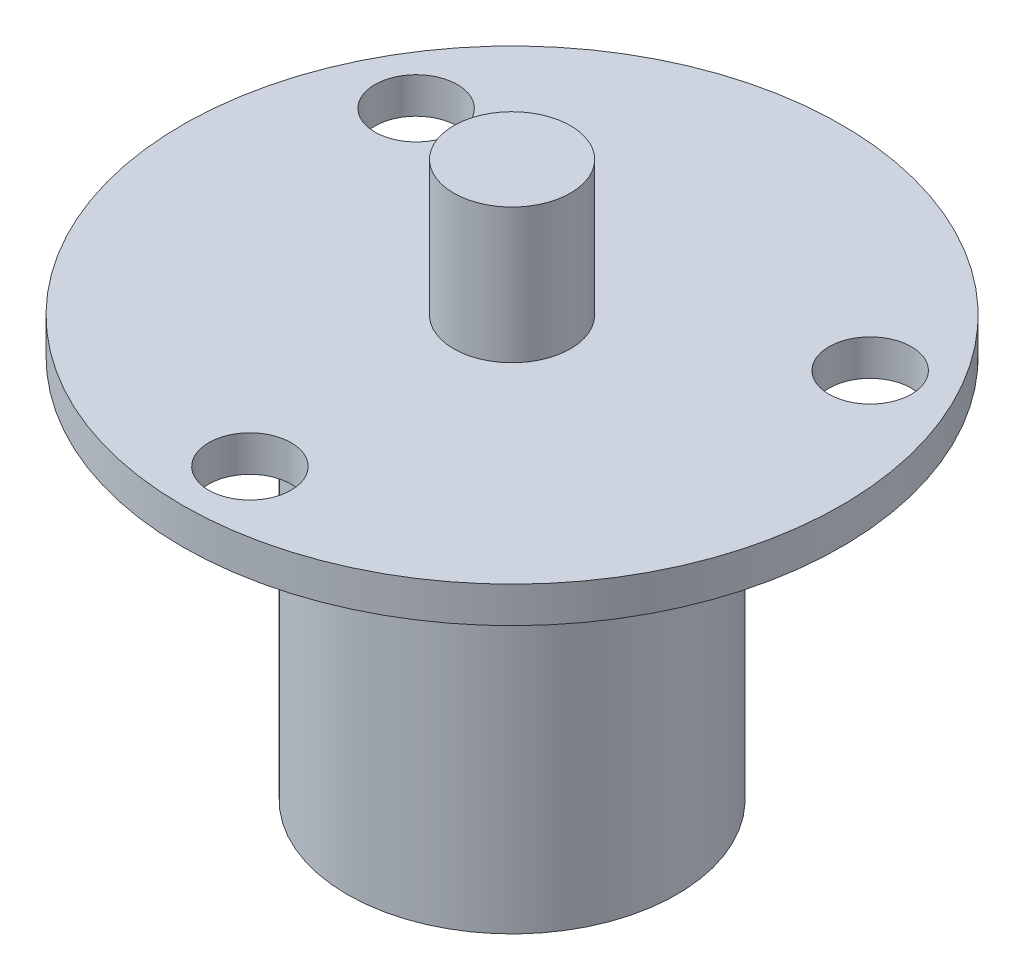
ISO-10303-21;
HEADER;
FILE_DESCRIPTION(('STEP AP214'),'2;1');
FILE_NAME('part.step','',(''),(''),'','','');
FILE_SCHEMA(('AUTOMOTIVE_DESIGN { 1 0 10303 214 1 1 1 1 }'));
ENDSEC;
DATA;
#1=APPLICATION_CONTEXT('core data for automotive mechanical design processes');
#2=APPLICATION_PROTOCOL_DEFINITION('international standard','automotive_design',2000,#1);
#3=PRODUCT_CONTEXT('',#1,'mechanical');
#4=PRODUCT('Part','Part','',(#3));
#5=PRODUCT_RELATED_PRODUCT_CATEGORY('part','',(#4));
#6=PRODUCT_DEFINITION_FORMATION('','',#4);
#7=PRODUCT_DEFINITION_CONTEXT('part definition',#1,'design');
#8=PRODUCT_DEFINITION('design','',#6,#7);
#9=PRODUCT_DEFINITION_SHAPE('','',#8);
#10=(LENGTH_UNIT() NAMED_UNIT(*) SI_UNIT(.MILLI.,.METRE.));
#11=(NAMED_UNIT(*) PLANE_ANGLE_UNIT() SI_UNIT($,.RADIAN.));
#12=(NAMED_UNIT(*) SI_UNIT($,.STERADIAN.) SOLID_ANGLE_UNIT());
#13=UNCERTAINTY_MEASURE_WITH_UNIT(LENGTH_MEASURE(1.E-05),#10,'distance_accuracy_value','');
#14=(GEOMETRIC_REPRESENTATION_CONTEXT(3) GLOBAL_UNCERTAINTY_ASSIGNED_CONTEXT((#13)) GLOBAL_UNIT_ASSIGNED_CONTEXT((#10,
#11,#12)) REPRESENTATION_CONTEXT('',''));
#15=CARTESIAN_POINT('',(0.,0.,0.));
#16=DIRECTION('',(0.,0.,1.));
#17=DIRECTION('',(1.,0.,0.));
#18=AXIS2_PLACEMENT_3D('',#15,#16,#17);
#19=CARTESIAN_POINT('',(0.,2.4,0.));
#20=DIRECTION('',(0.,1.,0.));
#21=DIRECTION('',(0.,0.,1.));
#22=AXIS2_PLACEMENT_3D('',#19,#20,#21);
#23=PLANE('',#22);
#24=CARTESIAN_POINT('',(0.,2.4,0.));
#25=DIRECTION('',(0.,1.,0.));
#26=DIRECTION('',(0.,0.,1.));
#27=AXIS2_PLACEMENT_3D('',#24,#25,#26);
#28=CIRCLE('',#27,3.9);
#29=CARTESIAN_POINT('',(0.,2.4,3.9));
#30=VERTEX_POINT('',#29);
#31=EDGE_CURVE('E94',#30,#30,#28,.T.);
#32=ORIENTED_EDGE('',*,*,#31,.F.);
#33=EDGE_LOOP('',(#32));
#34=FACE_BOUND('',#33,.T.);
#35=CARTESIAN_POINT('',(15.1554445662277,2.4,-8.75));
#36=DIRECTION('',(0.,1.,0.));
#37=DIRECTION('',(0.,0.,1.));
#38=AXIS2_PLACEMENT_3D('',#35,#36,#37);
#39=CIRCLE('',#38,2.75);
#40=CARTESIAN_POINT('',(15.1554445662277,2.4,-6.));
#41=VERTEX_POINT('',#40);
#42=EDGE_CURVE('E56',#41,#41,#39,.T.);
#43=ORIENTED_EDGE('',*,*,#42,.F.);
#44=EDGE_LOOP('',(#43));
#45=FACE_BOUND('',#44,.T.);
#46=CARTESIAN_POINT('',(0.,2.4,0.));
#47=DIRECTION('',(0.,1.,0.));
#48=DIRECTION('',(0.,0.,1.));
#49=AXIS2_PLACEMENT_3D('',#46,#47,#48);
#50=CIRCLE('',#49,22.);
#51=CARTESIAN_POINT('',(0.,2.4,22.));
#52=VERTEX_POINT('',#51);
#53=EDGE_CURVE('E40',#52,#52,#50,.T.);
#54=ORIENTED_EDGE('',*,*,#53,.T.);
#55=EDGE_LOOP('',(#54));
#56=FACE_BOUND('',#55,.T.);
#57=CARTESIAN_POINT('',(-15.1554445662277,2.4,-8.75));
#58=DIRECTION('',(0.,1.,0.));
#59=DIRECTION('',(0.,0.,1.));
#60=AXIS2_PLACEMENT_3D('',#57,#58,#59);
#61=CIRCLE('',#60,2.75);
#62=CARTESIAN_POINT('',(-15.1554445662277,2.4,-6.));
#63=VERTEX_POINT('',#62);
#64=EDGE_CURVE('E62',#63,#63,#61,.T.);
#65=ORIENTED_EDGE('',*,*,#64,.F.);
#66=EDGE_LOOP('',(#65));
#67=FACE_BOUND('',#66,.T.);
#68=CARTESIAN_POINT('',(0.,2.4,17.5));
#69=DIRECTION('',(0.,1.,0.));
#70=DIRECTION('',(0.,0.,1.));
#71=AXIS2_PLACEMENT_3D('',#68,#69,#70);
#72=CIRCLE('',#71,2.75);
#73=CARTESIAN_POINT('',(0.,2.4,20.25));
#74=VERTEX_POINT('',#73);
#75=EDGE_CURVE('E49',#74,#74,#72,.T.);
#76=ORIENTED_EDGE('',*,*,#75,.F.);
#77=EDGE_LOOP('',(#76));
#78=FACE_BOUND('',#77,.T.);
#79=ADVANCED_FACE('F32',(#34,#45,#56,#67,#78),#23,.T.);
#80=CARTESIAN_POINT('',(0.,0.,0.));
#81=DIRECTION('',(0.,1.,0.));
#82=DIRECTION('',(0.,0.,1.));
#83=AXIS2_PLACEMENT_3D('',#80,#81,#82);
#84=PLANE('',#83);
#85=CARTESIAN_POINT('',(0.,0.,0.));
#86=DIRECTION('',(0.,-1.,0.));
#87=DIRECTION('',(0.,0.,-1.));
#88=AXIS2_PLACEMENT_3D('',#85,#86,#87);
#89=CIRCLE('',#88,11.);
#90=CARTESIAN_POINT('',(0.,0.,-11.));
#91=VERTEX_POINT('',#90);
#92=EDGE_CURVE('E10',#91,#91,#89,.T.);
#93=ORIENTED_EDGE('',*,*,#92,.F.);
#94=EDGE_LOOP('',(#93));
#95=FACE_BOUND('',#94,.T.);
#96=CARTESIAN_POINT('',(0.,0.,0.));
#97=DIRECTION('',(0.,1.,0.));
#98=DIRECTION('',(0.,0.,1.));
#99=AXIS2_PLACEMENT_3D('',#96,#97,#98);
#100=CIRCLE('',#99,22.);
#101=CARTESIAN_POINT('',(0.,0.,22.));
#102=VERTEX_POINT('',#101);
#103=EDGE_CURVE('E36',#102,#102,#100,.T.);
#104=ORIENTED_EDGE('',*,*,#103,.F.);
#105=EDGE_LOOP('',(#104));
#106=FACE_BOUND('',#105,.T.);
#107=CARTESIAN_POINT('',(-15.1554445662277,0.,-8.75));
#108=DIRECTION('',(0.,1.,0.));
#109=DIRECTION('',(0.,0.,1.));
#110=AXIS2_PLACEMENT_3D('',#107,#108,#109);
#111=CIRCLE('',#110,2.75);
#112=CARTESIAN_POINT('',(-15.1554445662277,0.,-6.));
#113=VERTEX_POINT('',#112);
#114=EDGE_CURVE('E59',#113,#113,#111,.T.);
#115=ORIENTED_EDGE('',*,*,#114,.T.);
#116=EDGE_LOOP('',(#115));
#117=FACE_BOUND('',#116,.T.);
#118=CARTESIAN_POINT('',(15.1554445662277,0.,-8.75));
#119=DIRECTION('',(0.,1.,0.));
#120=DIRECTION('',(0.,0.,1.));
#121=AXIS2_PLACEMENT_3D('',#118,#119,#120);
#122=CIRCLE('',#121,2.75);
#123=CARTESIAN_POINT('',(15.1554445662277,0.,-6.));
#124=VERTEX_POINT('',#123);
#125=EDGE_CURVE('E52',#124,#124,#122,.T.);
#126=ORIENTED_EDGE('',*,*,#125,.T.);
#127=EDGE_LOOP('',(#126));
#128=FACE_BOUND('',#127,.T.);
#129=CARTESIAN_POINT('',(0.,0.,17.5));
#130=DIRECTION('',(0.,1.,0.));
#131=DIRECTION('',(0.,0.,1.));
#132=AXIS2_PLACEMENT_3D('',#129,#130,#131);
#133=CIRCLE('',#132,2.75);
#134=CARTESIAN_POINT('',(0.,0.,20.25));
#135=VERTEX_POINT('',#134);
#136=EDGE_CURVE('E53',#135,#135,#133,.T.);
#137=ORIENTED_EDGE('',*,*,#136,.T.);
#138=EDGE_LOOP('',(#137));
#139=FACE_BOUND('',#138,.T.);
#140=ADVANCED_FACE('F68',(#95,#106,#117,#128,#139),#84,.F.);
#141=CARTESIAN_POINT('',(0.,2.4,0.));
#142=DIRECTION('',(0.,-1.,0.));
#143=DIRECTION('',(0.,0.,-1.));
#144=AXIS2_PLACEMENT_3D('',#141,#142,#143);
#145=CYLINDRICAL_SURFACE('',#144,22.);
#146=ORIENTED_EDGE('',*,*,#53,.F.);
#147=EDGE_LOOP('',(#146));
#148=FACE_BOUND('',#147,.T.);
#149=ORIENTED_EDGE('',*,*,#103,.T.);
#150=EDGE_LOOP('',(#149));
#151=FACE_BOUND('',#150,.T.);
#152=ADVANCED_FACE('F34',(#148,#151),#145,.T.);
#153=CARTESIAN_POINT('',(-15.1554445662277,2.4,-8.75));
#154=DIRECTION('',(0.,-1.,0.));
#155=DIRECTION('',(0.,0.,-1.));
#156=AXIS2_PLACEMENT_3D('',#153,#154,#155);
#157=CYLINDRICAL_SURFACE('',#156,2.75);
#158=ORIENTED_EDGE('',*,*,#64,.T.);
#159=EDGE_LOOP('',(#158));
#160=FACE_BOUND('',#159,.T.);
#161=ORIENTED_EDGE('',*,*,#114,.F.);
#162=EDGE_LOOP('',(#161));
#163=FACE_BOUND('',#162,.T.);
#164=ADVANCED_FACE('F71',(#160,#163),#157,.F.);
#165=CARTESIAN_POINT('',(15.1554445662277,2.4,-8.75));
#166=DIRECTION('',(0.,-1.,0.));
#167=DIRECTION('',(0.,0.,-1.));
#168=AXIS2_PLACEMENT_3D('',#165,#166,#167);
#169=CYLINDRICAL_SURFACE('',#168,2.75);
#170=ORIENTED_EDGE('',*,*,#42,.T.);
#171=EDGE_LOOP('',(#170));
#172=FACE_BOUND('',#171,.T.);
#173=ORIENTED_EDGE('',*,*,#125,.F.);
#174=EDGE_LOOP('',(#173));
#175=FACE_BOUND('',#174,.T.);
#176=ADVANCED_FACE('F73',(#172,#175),#169,.F.);
#177=CARTESIAN_POINT('',(0.,2.4,17.5));
#178=DIRECTION('',(0.,-1.,0.));
#179=DIRECTION('',(0.,0.,-1.));
#180=AXIS2_PLACEMENT_3D('',#177,#178,#179);
#181=CYLINDRICAL_SURFACE('',#180,2.75);
#182=ORIENTED_EDGE('',*,*,#75,.T.);
#183=EDGE_LOOP('',(#182));
#184=FACE_BOUND('',#183,.T.);
#185=ORIENTED_EDGE('',*,*,#136,.F.);
#186=EDGE_LOOP('',(#185));
#187=FACE_BOUND('',#186,.T.);
#188=ADVANCED_FACE('F80',(#184,#187),#181,.F.);
#189=CARTESIAN_POINT('',(0.,-25.6,0.));
#190=DIRECTION('',(0.,1.,0.));
#191=DIRECTION('',(0.,0.,1.));
#192=AXIS2_PLACEMENT_3D('',#189,#190,#191);
#193=CYLINDRICAL_SURFACE('',#192,11.);
#194=CARTESIAN_POINT('',(0.,-25.6,0.));
#195=DIRECTION('',(0.,-1.,0.));
#196=DIRECTION('',(0.,0.,-1.));
#197=AXIS2_PLACEMENT_3D('',#194,#195,#196);
#198=CIRCLE('',#197,11.);
#199=CARTESIAN_POINT('',(0.,-25.6,-11.));
#200=VERTEX_POINT('',#199);
#201=EDGE_CURVE('E47',#200,#200,#198,.T.);
#202=ORIENTED_EDGE('',*,*,#201,.F.);
#203=EDGE_LOOP('',(#202));
#204=FACE_BOUND('',#203,.T.);
#205=ORIENTED_EDGE('',*,*,#92,.T.);
#206=EDGE_LOOP('',(#205));
#207=FACE_BOUND('',#206,.T.);
#208=ADVANCED_FACE('F105',(#204,#207),#193,.T.);
#209=CARTESIAN_POINT('',(0.,-25.6,0.));
#210=DIRECTION('',(0.,-1.,0.));
#211=DIRECTION('',(0.,0.,-1.));
#212=AXIS2_PLACEMENT_3D('',#209,#210,#211);
#213=PLANE('',#212);
#214=ORIENTED_EDGE('',*,*,#201,.T.);
#215=EDGE_LOOP('',(#214));
#216=FACE_BOUND('',#215,.T.);
#217=ADVANCED_FACE('F112',(#216),#213,.T.);
#218=CARTESIAN_POINT('',(0.,11.4,0.));
#219=DIRECTION('',(0.,-1.,0.));
#220=DIRECTION('',(0.,0.,-1.));
#221=AXIS2_PLACEMENT_3D('',#218,#219,#220);
#222=CYLINDRICAL_SURFACE('',#221,3.9);
#223=CARTESIAN_POINT('',(0.,11.4,0.));
#224=DIRECTION('',(0.,1.,0.));
#225=DIRECTION('',(0.,0.,1.));
#226=AXIS2_PLACEMENT_3D('',#223,#224,#225);
#227=CIRCLE('',#226,3.9);
#228=CARTESIAN_POINT('',(0.,11.4,3.9));
#229=VERTEX_POINT('',#228);
#230=EDGE_CURVE('E130',#229,#229,#227,.T.);
#231=ORIENTED_EDGE('',*,*,#230,.F.);
#232=EDGE_LOOP('',(#231));
#233=FACE_BOUND('',#232,.T.);
#234=ORIENTED_EDGE('',*,*,#31,.T.);
#235=EDGE_LOOP('',(#234));
#236=FACE_BOUND('',#235,.T.);
#237=ADVANCED_FACE('F118',(#233,#236),#222,.T.);
#238=CARTESIAN_POINT('',(0.,11.4,0.));
#239=DIRECTION('',(0.,1.,0.));
#240=DIRECTION('',(0.,0.,1.));
#241=AXIS2_PLACEMENT_3D('',#238,#239,#240);
#242=PLANE('',#241);
#243=ORIENTED_EDGE('',*,*,#230,.T.);
#244=EDGE_LOOP('',(#243));
#245=FACE_BOUND('',#244,.T.);
#246=ADVANCED_FACE('F122',(#245),#242,.T.);
#247=CLOSED_SHELL('',(#79,#140,#152,#164,#176,#188,#208,#217,#237,#246));
#248=MANIFOLD_SOLID_BREP('B2',#247);
#249=ADVANCED_BREP_SHAPE_REPRESENTATION('',(#18,#248),#14);
#250=SHAPE_DEFINITION_REPRESENTATION(#9,#249);
ENDSEC;
END-ISO-10303-21;
